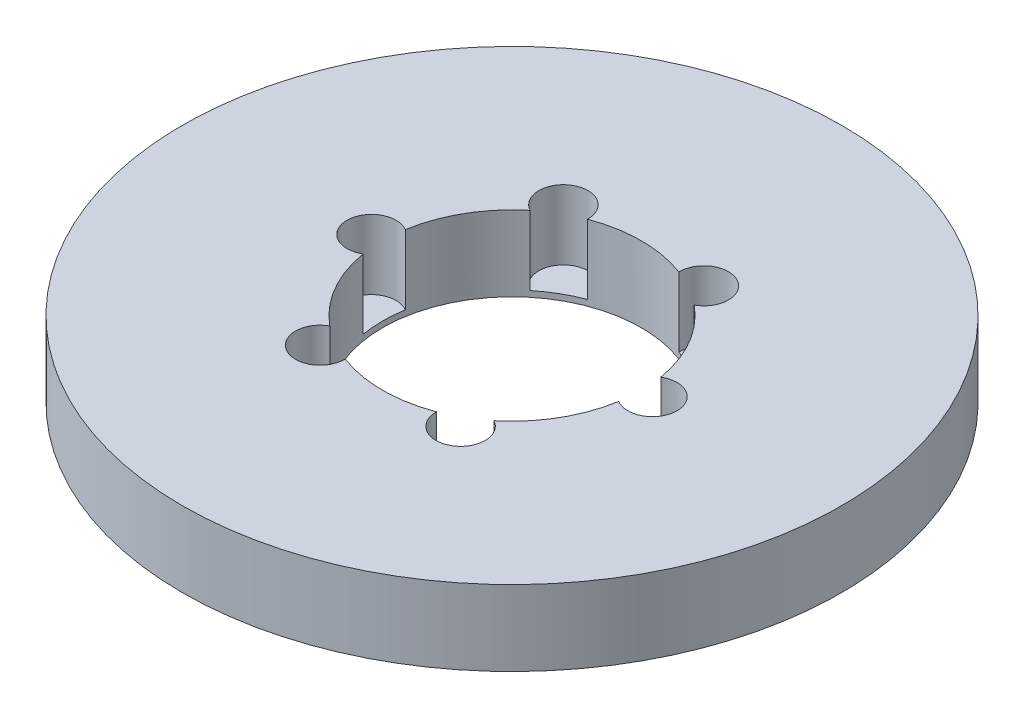
ISO-10303-21;
HEADER;
FILE_DESCRIPTION(('STEP AP214'),'2;1');
FILE_NAME('part.step','',(''),(''),'','','');
FILE_SCHEMA(('AUTOMOTIVE_DESIGN { 1 0 10303 214 1 1 1 1 }'));
ENDSEC;
DATA;
#1=APPLICATION_CONTEXT('core data for automotive mechanical design processes');
#2=APPLICATION_PROTOCOL_DEFINITION('international standard','automotive_design',2000,#1);
#3=PRODUCT_CONTEXT('',#1,'mechanical');
#4=PRODUCT('Part','Part','',(#3));
#5=PRODUCT_RELATED_PRODUCT_CATEGORY('part','',(#4));
#6=PRODUCT_DEFINITION_FORMATION('','',#4);
#7=PRODUCT_DEFINITION_CONTEXT('part definition',#1,'design');
#8=PRODUCT_DEFINITION('design','',#6,#7);
#9=PRODUCT_DEFINITION_SHAPE('','',#8);
#10=(LENGTH_UNIT() NAMED_UNIT(*) SI_UNIT(.MILLI.,.METRE.));
#11=(NAMED_UNIT(*) PLANE_ANGLE_UNIT() SI_UNIT($,.RADIAN.));
#12=(NAMED_UNIT(*) SI_UNIT($,.STERADIAN.) SOLID_ANGLE_UNIT());
#13=UNCERTAINTY_MEASURE_WITH_UNIT(LENGTH_MEASURE(1.E-05),#10,'distance_accuracy_value','');
#14=(GEOMETRIC_REPRESENTATION_CONTEXT(3) GLOBAL_UNCERTAINTY_ASSIGNED_CONTEXT((#13)) GLOBAL_UNIT_ASSIGNED_CONTEXT((#10,
#11,#12)) REPRESENTATION_CONTEXT('',''));
#15=CARTESIAN_POINT('',(0.,0.,0.));
#16=DIRECTION('',(0.,0.,1.));
#17=DIRECTION('',(1.,0.,0.));
#18=AXIS2_PLACEMENT_3D('',#15,#16,#17);
#19=CARTESIAN_POINT('',(0.,16.,0.));
#20=DIRECTION('',(0.,-1.,0.));
#21=DIRECTION('',(0.,0.,-1.));
#22=AXIS2_PLACEMENT_3D('',#19,#20,#21);
#23=CYLINDRICAL_SURFACE('',#22,70.);
#24=CARTESIAN_POINT('',(0.,16.,0.));
#25=DIRECTION('',(0.,1.,0.));
#26=DIRECTION('',(0.,0.,1.));
#27=AXIS2_PLACEMENT_3D('',#24,#25,#26);
#28=CIRCLE('',#27,70.);
#29=CARTESIAN_POINT('',(0.,16.,70.));
#30=VERTEX_POINT('',#29);
#31=EDGE_CURVE('E171',#30,#30,#28,.T.);
#32=ORIENTED_EDGE('',*,*,#31,.F.);
#33=EDGE_LOOP('',(#32));
#34=FACE_BOUND('',#33,.T.);
#35=CARTESIAN_POINT('',(0.,0.,0.));
#36=DIRECTION('',(0.,1.,0.));
#37=DIRECTION('',(0.,0.,1.));
#38=AXIS2_PLACEMENT_3D('',#35,#36,#37);
#39=CIRCLE('',#38,70.);
#40=CARTESIAN_POINT('',(0.,0.,70.));
#41=VERTEX_POINT('',#40);
#42=EDGE_CURVE('E157',#41,#41,#39,.T.);
#43=ORIENTED_EDGE('',*,*,#42,.T.);
#44=EDGE_LOOP('',(#43));
#45=FACE_BOUND('',#44,.T.);
#46=ADVANCED_FACE('F39',(#34,#45),#23,.T.);
#47=CARTESIAN_POINT('',(0.,16.,0.));
#48=DIRECTION('',(0.,1.,0.));
#49=DIRECTION('',(0.,0.,1.));
#50=AXIS2_PLACEMENT_3D('',#47,#48,#49);
#51=PLANE('',#50);
#52=CARTESIAN_POINT('',(-14.9195019596037,16.,-25.8413354176564));
#53=DIRECTION('',(0.,1.,0.));
#54=DIRECTION('',(-0.866025403784433,0.,0.50000000000001));
#55=AXIS2_PLACEMENT_3D('',#52,#53,#54);
#56=CIRCLE('',#55,5.21964115967071);
#57=CARTESIAN_POINT('',(-9.70100413533416,16.,-25.732091224116));
#58=VERTEX_POINT('',#57);
#59=CARTESIAN_POINT('',(-17.4341426249165,16.,-21.2673616354749));
#60=VERTEX_POINT('',#59);
#61=EDGE_CURVE('E214',#58,#60,#56,.T.);
#62=ORIENTED_EDGE('',*,*,#61,.F.);
#63=CARTESIAN_POINT('',(0.,16.,0.));
#64=DIRECTION('',(0.,1.,0.));
#65=DIRECTION('',(0.,0.,1.));
#66=AXIS2_PLACEMENT_3D('',#63,#64,#65);
#67=CIRCLE('',#66,27.5);
#68=CARTESIAN_POINT('',(9.70100413533362,16.,-25.7320912241162));
#69=VERTEX_POINT('',#68);
#70=EDGE_CURVE('E272',#69,#58,#67,.T.);
#71=ORIENTED_EDGE('',*,*,#70,.F.);
#72=CARTESIAN_POINT('',(14.9195019596032,16.,-25.8413354176567));
#73=DIRECTION('',(0.,1.,0.));
#74=DIRECTION('',(-0.866025403784443,0.,-0.499999999999992));
#75=AXIS2_PLACEMENT_3D('',#72,#73,#74);
#76=CIRCLE('',#75,5.21964115967071);
#77=CARTESIAN_POINT('',(17.4341426249161,16.,-21.2673616354753));
#78=VERTEX_POINT('',#77);
#79=EDGE_CURVE('E285',#78,#69,#76,.T.);
#80=ORIENTED_EDGE('',*,*,#79,.F.);
#81=CARTESIAN_POINT('',(27.1351467602501,16.,-4.46472958864106));
#82=VERTEX_POINT('',#81);
#83=EDGE_CURVE('E165',#82,#78,#67,.T.);
#84=ORIENTED_EDGE('',*,*,#83,.F.);
#85=CARTESIAN_POINT('',(29.8390039192069,16.,0.));
#86=DIRECTION('',(0.,1.,0.));
#87=DIRECTION('',(0.,0.,-1.));
#88=AXIS2_PLACEMENT_3D('',#85,#86,#87);
#89=CIRCLE('',#88,5.21964115967071);
#90=CARTESIAN_POINT('',(27.1351467602501,16.,4.46472958864106));
#91=VERTEX_POINT('',#90);
#92=EDGE_CURVE('E281',#91,#82,#89,.T.);
#93=ORIENTED_EDGE('',*,*,#92,.F.);
#94=CARTESIAN_POINT('',(17.4341426249164,16.,21.267361635475));
#95=VERTEX_POINT('',#94);
#96=EDGE_CURVE('E160',#95,#91,#67,.T.);
#97=ORIENTED_EDGE('',*,*,#96,.F.);
#98=CARTESIAN_POINT('',(14.9195019596036,16.,25.8413354176565));
#99=DIRECTION('',(0.,1.,0.));
#100=DIRECTION('',(0.866025403784436,0.,-0.500000000000004));
#101=AXIS2_PLACEMENT_3D('',#98,#99,#100);
#102=CIRCLE('',#101,5.21964115967071);
#103=CARTESIAN_POINT('',(9.70100413533398,16.,25.7320912241161));
#104=VERTEX_POINT('',#103);
#105=EDGE_CURVE('E154',#104,#95,#102,.T.);
#106=ORIENTED_EDGE('',*,*,#105,.F.);
#107=CARTESIAN_POINT('',(-9.7010041353338,16.,25.7320912241162));
#108=VERTEX_POINT('',#107);
#109=EDGE_CURVE('E150',#108,#104,#67,.T.);
#110=ORIENTED_EDGE('',*,*,#109,.F.);
#111=CARTESIAN_POINT('',(-14.9195019596034,16.,25.8413354176566));
#112=DIRECTION('',(0.,1.,0.));
#113=DIRECTION('',(0.86602540378444,0.,0.499999999999998));
#114=AXIS2_PLACEMENT_3D('',#111,#112,#113);
#115=CIRCLE('',#114,5.21964115967071);
#116=CARTESIAN_POINT('',(-17.4341426249162,16.,21.2673616354751));
#117=VERTEX_POINT('',#116);
#118=EDGE_CURVE('E127',#117,#108,#115,.T.);
#119=ORIENTED_EDGE('',*,*,#118,.F.);
#120=CARTESIAN_POINT('',(-27.1351467602501,16.,4.46472958864106));
#121=VERTEX_POINT('',#120);
#122=EDGE_CURVE('E156',#121,#117,#67,.T.);
#123=ORIENTED_EDGE('',*,*,#122,.F.);
#124=CARTESIAN_POINT('',(-29.8390039192069,16.,0.));
#125=DIRECTION('',(0.,1.,0.));
#126=DIRECTION('',(0.,0.,1.));
#127=AXIS2_PLACEMENT_3D('',#124,#125,#126);
#128=CIRCLE('',#127,5.21964115967071);
#129=CARTESIAN_POINT('',(-27.1351467602501,16.,-4.46472958864106));
#130=VERTEX_POINT('',#129);
#131=EDGE_CURVE('E164',#130,#121,#128,.T.);
#132=ORIENTED_EDGE('',*,*,#131,.F.);
#133=EDGE_CURVE('E159',#60,#130,#67,.T.);
#134=ORIENTED_EDGE('',*,*,#133,.F.);
#135=EDGE_LOOP('',(#62,#71,#80,#84,#93,#97,#106,#110,#119,#123,#132,#134));
#136=FACE_BOUND('',#135,.T.);
#137=ORIENTED_EDGE('',*,*,#31,.T.);
#138=EDGE_LOOP('',(#137));
#139=FACE_BOUND('',#138,.T.);
#140=ADVANCED_FACE('F155',(#136,#139),#51,.T.);
#141=CARTESIAN_POINT('',(0.,0.,0.));
#142=DIRECTION('',(0.,1.,0.));
#143=DIRECTION('',(0.,0.,1.));
#144=AXIS2_PLACEMENT_3D('',#141,#142,#143);
#145=PLANE('',#144);
#146=CARTESIAN_POINT('',(0.,0.,0.));
#147=DIRECTION('',(0.,1.,0.));
#148=DIRECTION('',(0.,0.,1.));
#149=AXIS2_PLACEMENT_3D('',#146,#147,#148);
#150=CIRCLE('',#149,27.5);
#151=CARTESIAN_POINT('',(0.,0.,27.5));
#152=VERTEX_POINT('',#151);
#153=EDGE_CURVE('E170',#152,#152,#150,.T.);
#154=ORIENTED_EDGE('',*,*,#153,.T.);
#155=EDGE_LOOP('',(#154));
#156=FACE_BOUND('',#155,.T.);
#157=ORIENTED_EDGE('',*,*,#42,.F.);
#158=EDGE_LOOP('',(#157));
#159=FACE_BOUND('',#158,.T.);
#160=ADVANCED_FACE('F232',(#156,#159),#145,.F.);
#161=CARTESIAN_POINT('',(0.,16.,0.));
#162=DIRECTION('',(0.,-1.,0.));
#163=DIRECTION('',(0.,0.,-1.));
#164=AXIS2_PLACEMENT_3D('',#161,#162,#163);
#165=CYLINDRICAL_SURFACE('',#164,27.5);
#166=DIRECTION('',(0.,1.,0.));
#167=VECTOR('',#166,1.);
#168=CARTESIAN_POINT('',(-9.70100413533416,8.61944924961575,-25.732091224116));
#169=LINE('',#168,#167);
#170=CARTESIAN_POINT('',(-9.70100413533416,1.23889849923151,-25.732091224116));
#171=VERTEX_POINT('',#170);
#172=EDGE_CURVE('E11',#171,#58,#169,.T.);
#173=ORIENTED_EDGE('',*,*,#172,.F.);
#174=CARTESIAN_POINT('',(0.,1.23889849923151,0.));
#175=DIRECTION('',(0.,1.,0.));
#176=DIRECTION('',(0.,0.,1.));
#177=AXIS2_PLACEMENT_3D('',#174,#175,#176);
#178=CIRCLE('',#177,27.5);
#179=CARTESIAN_POINT('',(-17.4341426249165,1.23889849923151,-21.2673616354749));
#180=VERTEX_POINT('',#179);
#181=EDGE_CURVE('E209',#171,#180,#178,.T.);
#182=ORIENTED_EDGE('',*,*,#181,.T.);
#183=DIRECTION('',(0.,1.,0.));
#184=VECTOR('',#183,1.);
#185=CARTESIAN_POINT('',(-17.4341426249165,8.61944924961575,-21.2673616354749));
#186=LINE('',#185,#184);
#187=EDGE_CURVE('E46',#60,#180,#186,.F.);
#188=ORIENTED_EDGE('',*,*,#187,.F.);
#189=ORIENTED_EDGE('',*,*,#133,.T.);
#190=DIRECTION('',(0.,1.,0.));
#191=VECTOR('',#190,1.);
#192=CARTESIAN_POINT('',(-27.1351467602501,8.61944924961575,-4.46472958864106));
#193=LINE('',#192,#191);
#194=CARTESIAN_POINT('',(-27.1351467602501,1.23889849923151,-4.46472958864106));
#195=VERTEX_POINT('',#194);
#196=EDGE_CURVE('E185',#195,#130,#193,.T.);
#197=ORIENTED_EDGE('',*,*,#196,.F.);
#198=CARTESIAN_POINT('',(0.,1.23889849923151,0.));
#199=DIRECTION('',(0.,1.,0.));
#200=DIRECTION('',(0.,0.,1.));
#201=AXIS2_PLACEMENT_3D('',#198,#199,#200);
#202=CIRCLE('',#201,27.5);
#203=CARTESIAN_POINT('',(-27.1351467602501,1.23889849923151,4.46472958864106));
#204=VERTEX_POINT('',#203);
#205=EDGE_CURVE('E173',#195,#204,#202,.T.);
#206=ORIENTED_EDGE('',*,*,#205,.T.);
#207=DIRECTION('',(0.,1.,0.));
#208=VECTOR('',#207,1.);
#209=CARTESIAN_POINT('',(-27.1351467602501,8.61944924961575,4.46472958864106));
#210=LINE('',#209,#208);
#211=EDGE_CURVE('E178',#121,#204,#210,.F.);
#212=ORIENTED_EDGE('',*,*,#211,.F.);
#213=ORIENTED_EDGE('',*,*,#122,.T.);
#214=DIRECTION('',(0.,1.,0.));
#215=VECTOR('',#214,1.);
#216=CARTESIAN_POINT('',(-17.4341426249162,8.61944924961575,21.2673616354751));
#217=LINE('',#216,#215);
#218=CARTESIAN_POINT('',(-17.4341426249162,1.23889849923151,21.2673616354751));
#219=VERTEX_POINT('',#218);
#220=EDGE_CURVE('E132',#219,#117,#217,.T.);
#221=ORIENTED_EDGE('',*,*,#220,.F.);
#222=CARTESIAN_POINT('',(0.,1.23889849923151,0.));
#223=DIRECTION('',(0.,1.,0.));
#224=DIRECTION('',(0.,0.,1.));
#225=AXIS2_PLACEMENT_3D('',#222,#223,#224);
#226=CIRCLE('',#225,27.5);
#227=CARTESIAN_POINT('',(-9.7010041353338,1.23889849923151,25.7320912241162));
#228=VERTEX_POINT('',#227);
#229=EDGE_CURVE('E146',#219,#228,#226,.T.);
#230=ORIENTED_EDGE('',*,*,#229,.T.);
#231=DIRECTION('',(0.,1.,0.));
#232=VECTOR('',#231,1.);
#233=CARTESIAN_POINT('',(-9.7010041353338,8.61944924961575,25.7320912241162));
#234=LINE('',#233,#232);
#235=EDGE_CURVE('E128',#108,#228,#234,.F.);
#236=ORIENTED_EDGE('',*,*,#235,.F.);
#237=ORIENTED_EDGE('',*,*,#109,.T.);
#238=DIRECTION('',(0.,1.,0.));
#239=VECTOR('',#238,1.);
#240=CARTESIAN_POINT('',(9.70100413533398,8.61944924961575,25.7320912241161));
#241=LINE('',#240,#239);
#242=CARTESIAN_POINT('',(9.70100413533398,1.23889849923151,25.7320912241161));
#243=VERTEX_POINT('',#242);
#244=EDGE_CURVE('E192',#243,#104,#241,.T.);
#245=ORIENTED_EDGE('',*,*,#244,.F.);
#246=CARTESIAN_POINT('',(0.,1.23889849923151,0.));
#247=DIRECTION('',(0.,1.,0.));
#248=DIRECTION('',(0.,0.,1.));
#249=AXIS2_PLACEMENT_3D('',#246,#247,#248);
#250=CIRCLE('',#249,27.5);
#251=CARTESIAN_POINT('',(17.4341426249164,1.23889849923151,21.267361635475));
#252=VERTEX_POINT('',#251);
#253=EDGE_CURVE('E190',#243,#252,#250,.T.);
#254=ORIENTED_EDGE('',*,*,#253,.T.);
#255=DIRECTION('',(0.,1.,0.));
#256=VECTOR('',#255,1.);
#257=CARTESIAN_POINT('',(17.4341426249164,8.61944924961575,21.267361635475));
#258=LINE('',#257,#256);
#259=EDGE_CURVE('E189',#95,#252,#258,.F.);
#260=ORIENTED_EDGE('',*,*,#259,.F.);
#261=ORIENTED_EDGE('',*,*,#96,.T.);
#262=DIRECTION('',(0.,1.,0.));
#263=VECTOR('',#262,1.);
#264=CARTESIAN_POINT('',(27.1351467602501,8.61944924961575,4.46472958864106));
#265=LINE('',#264,#263);
#266=CARTESIAN_POINT('',(27.1351467602501,1.23889849923151,4.46472958864106));
#267=VERTEX_POINT('',#266);
#268=EDGE_CURVE('E203',#267,#91,#265,.T.);
#269=ORIENTED_EDGE('',*,*,#268,.F.);
#270=CARTESIAN_POINT('',(0.,1.23889849923151,0.));
#271=DIRECTION('',(0.,1.,0.));
#272=DIRECTION('',(0.,0.,1.));
#273=AXIS2_PLACEMENT_3D('',#270,#271,#272);
#274=CIRCLE('',#273,27.5);
#275=CARTESIAN_POINT('',(27.1351467602501,1.23889849923151,-4.46472958864106));
#276=VERTEX_POINT('',#275);
#277=EDGE_CURVE('E194',#267,#276,#274,.T.);
#278=ORIENTED_EDGE('',*,*,#277,.T.);
#279=DIRECTION('',(0.,1.,0.));
#280=VECTOR('',#279,1.);
#281=CARTESIAN_POINT('',(27.1351467602501,8.61944924961575,-4.46472958864106));
#282=LINE('',#281,#280);
#283=EDGE_CURVE('E196',#82,#276,#282,.F.);
#284=ORIENTED_EDGE('',*,*,#283,.F.);
#285=ORIENTED_EDGE('',*,*,#83,.T.);
#286=DIRECTION('',(0.,1.,0.));
#287=VECTOR('',#286,1.);
#288=CARTESIAN_POINT('',(17.4341426249161,8.61944924961575,-21.2673616354752));
#289=LINE('',#288,#287);
#290=CARTESIAN_POINT('',(17.4341426249161,1.23889849923151,-21.2673616354753));
#291=VERTEX_POINT('',#290);
#292=EDGE_CURVE('E208',#291,#78,#289,.T.);
#293=ORIENTED_EDGE('',*,*,#292,.F.);
#294=CARTESIAN_POINT('',(0.,1.23889849923151,0.));
#295=DIRECTION('',(0.,1.,0.));
#296=DIRECTION('',(0.,0.,1.));
#297=AXIS2_PLACEMENT_3D('',#294,#295,#296);
#298=CIRCLE('',#297,27.5);
#299=CARTESIAN_POINT('',(9.70100413533362,1.23889849923151,-25.7320912241162));
#300=VERTEX_POINT('',#299);
#301=EDGE_CURVE('E201',#291,#300,#298,.T.);
#302=ORIENTED_EDGE('',*,*,#301,.T.);
#303=DIRECTION('',(0.,1.,0.));
#304=VECTOR('',#303,1.);
#305=CARTESIAN_POINT('',(9.70100413533362,8.61944924961575,-25.7320912241162));
#306=LINE('',#305,#304);
#307=EDGE_CURVE('E206',#69,#300,#306,.F.);
#308=ORIENTED_EDGE('',*,*,#307,.F.);
#309=ORIENTED_EDGE('',*,*,#70,.T.);
#310=EDGE_LOOP('',(#173,#182,#188,#189,#197,#206,#212,#213,#221,#230,#236,#237,#245,#254,#260,
#261,#269,#278,#284,#285,#293,#302,#308,#309));
#311=FACE_BOUND('',#310,.T.);
#312=ORIENTED_EDGE('',*,*,#153,.F.);
#313=EDGE_LOOP('',(#312));
#314=FACE_BOUND('',#313,.T.);
#315=ADVANCED_FACE('F145',(#311,#314),#165,.F.);
#316=CARTESIAN_POINT('',(-29.8390039192069,1.23889849923151,0.));
#317=DIRECTION('',(0.,1.,0.));
#318=DIRECTION('',(0.,0.,1.));
#319=AXIS2_PLACEMENT_3D('',#316,#317,#318);
#320=CYLINDRICAL_SURFACE('',#319,5.21964115967071);
#321=ORIENTED_EDGE('',*,*,#196,.T.);
#322=ORIENTED_EDGE('',*,*,#131,.T.);
#323=ORIENTED_EDGE('',*,*,#211,.T.);
#324=CARTESIAN_POINT('',(-29.8390039192069,1.23889849923151,0.));
#325=DIRECTION('',(0.,1.,0.));
#326=DIRECTION('',(0.,0.,1.));
#327=AXIS2_PLACEMENT_3D('',#324,#325,#326);
#328=CIRCLE('',#327,5.21964115967071);
#329=EDGE_CURVE('E168',#195,#204,#328,.T.);
#330=ORIENTED_EDGE('',*,*,#329,.F.);
#331=EDGE_LOOP('',(#321,#322,#323,#330));
#332=FACE_BOUND('',#331,.T.);
#333=ADVANCED_FACE('F243',(#332),#320,.F.);
#334=CARTESIAN_POINT('',(-29.8390039192069,1.23889849923151,0.));
#335=DIRECTION('',(0.,1.,0.));
#336=DIRECTION('',(0.,0.,1.));
#337=AXIS2_PLACEMENT_3D('',#334,#335,#336);
#338=PLANE('',#337);
#339=ORIENTED_EDGE('',*,*,#329,.T.);
#340=ORIENTED_EDGE('',*,*,#205,.F.);
#341=EDGE_LOOP('',(#339,#340));
#342=FACE_BOUND('',#341,.T.);
#343=ADVANCED_FACE('F247',(#342),#338,.T.);
#344=CARTESIAN_POINT('',(-14.9195019596034,1.23889849923151,25.8413354176566));
#345=DIRECTION('',(0.,1.,0.));
#346=DIRECTION('',(0.,0.,1.));
#347=AXIS2_PLACEMENT_3D('',#344,#345,#346);
#348=CYLINDRICAL_SURFACE('',#347,5.21964115967071);
#349=ORIENTED_EDGE('',*,*,#220,.T.);
#350=ORIENTED_EDGE('',*,*,#118,.T.);
#351=ORIENTED_EDGE('',*,*,#235,.T.);
#352=CARTESIAN_POINT('',(-14.9195019596034,1.23889849923151,25.8413354176566));
#353=DIRECTION('',(0.,1.,0.));
#354=DIRECTION('',(0.86602540378444,0.,0.499999999999998));
#355=AXIS2_PLACEMENT_3D('',#352,#353,#354);
#356=CIRCLE('',#355,5.21964115967071);
#357=EDGE_CURVE('E137',#219,#228,#356,.T.);
#358=ORIENTED_EDGE('',*,*,#357,.F.);
#359=EDGE_LOOP('',(#349,#350,#351,#358));
#360=FACE_BOUND('',#359,.T.);
#361=ADVANCED_FACE('F126',(#360),#348,.F.);
#362=CARTESIAN_POINT('',(-14.9195019596034,1.23889849923151,25.8413354176566));
#363=DIRECTION('',(0.,1.,0.));
#364=DIRECTION('',(0.86602540378444,0.,0.499999999999998));
#365=AXIS2_PLACEMENT_3D('',#362,#363,#364);
#366=PLANE('',#365);
#367=ORIENTED_EDGE('',*,*,#357,.T.);
#368=ORIENTED_EDGE('',*,*,#229,.F.);
#369=EDGE_LOOP('',(#367,#368));
#370=FACE_BOUND('',#369,.T.);
#371=ADVANCED_FACE('F254',(#370),#366,.T.);
#372=CARTESIAN_POINT('',(14.9195019596036,1.23889849923151,25.8413354176565));
#373=DIRECTION('',(0.,1.,0.));
#374=DIRECTION('',(0.,0.,1.));
#375=AXIS2_PLACEMENT_3D('',#372,#373,#374);
#376=CYLINDRICAL_SURFACE('',#375,5.21964115967071);
#377=ORIENTED_EDGE('',*,*,#244,.T.);
#378=ORIENTED_EDGE('',*,*,#105,.T.);
#379=ORIENTED_EDGE('',*,*,#259,.T.);
#380=CARTESIAN_POINT('',(14.9195019596036,1.23889849923151,25.8413354176565));
#381=DIRECTION('',(0.,1.,0.));
#382=DIRECTION('',(0.866025403784436,0.,-0.500000000000004));
#383=AXIS2_PLACEMENT_3D('',#380,#381,#382);
#384=CIRCLE('',#383,5.21964115967071);
#385=EDGE_CURVE('E138',#243,#252,#384,.T.);
#386=ORIENTED_EDGE('',*,*,#385,.F.);
#387=EDGE_LOOP('',(#377,#378,#379,#386));
#388=FACE_BOUND('',#387,.T.);
#389=ADVANCED_FACE('F260',(#388),#376,.F.);
#390=CARTESIAN_POINT('',(14.9195019596036,1.23889849923151,25.8413354176565));
#391=DIRECTION('',(0.,1.,0.));
#392=DIRECTION('',(0.866025403784436,0.,-0.500000000000004));
#393=AXIS2_PLACEMENT_3D('',#390,#391,#392);
#394=PLANE('',#393);
#395=ORIENTED_EDGE('',*,*,#385,.T.);
#396=ORIENTED_EDGE('',*,*,#253,.F.);
#397=EDGE_LOOP('',(#395,#396));
#398=FACE_BOUND('',#397,.T.);
#399=ADVANCED_FACE('F265',(#398),#394,.T.);
#400=CARTESIAN_POINT('',(29.8390039192069,1.23889849923151,0.));
#401=DIRECTION('',(0.,1.,0.));
#402=DIRECTION('',(0.,0.,1.));
#403=AXIS2_PLACEMENT_3D('',#400,#401,#402);
#404=CYLINDRICAL_SURFACE('',#403,5.21964115967071);
#405=ORIENTED_EDGE('',*,*,#268,.T.);
#406=ORIENTED_EDGE('',*,*,#92,.T.);
#407=ORIENTED_EDGE('',*,*,#283,.T.);
#408=CARTESIAN_POINT('',(29.8390039192069,1.23889849923151,0.));
#409=DIRECTION('',(0.,1.,0.));
#410=DIRECTION('',(0.,0.,-1.));
#411=AXIS2_PLACEMENT_3D('',#408,#409,#410);
#412=CIRCLE('',#411,5.21964115967071);
#413=EDGE_CURVE('E287',#267,#276,#412,.T.);
#414=ORIENTED_EDGE('',*,*,#413,.F.);
#415=EDGE_LOOP('',(#405,#406,#407,#414));
#416=FACE_BOUND('',#415,.T.);
#417=ADVANCED_FACE('F300',(#416),#404,.F.);
#418=CARTESIAN_POINT('',(29.8390039192069,1.23889849923151,0.));
#419=DIRECTION('',(0.,1.,0.));
#420=DIRECTION('',(0.,0.,-1.));
#421=AXIS2_PLACEMENT_3D('',#418,#419,#420);
#422=PLANE('',#421);
#423=ORIENTED_EDGE('',*,*,#413,.T.);
#424=ORIENTED_EDGE('',*,*,#277,.F.);
#425=EDGE_LOOP('',(#423,#424));
#426=FACE_BOUND('',#425,.T.);
#427=ADVANCED_FACE('F298',(#426),#422,.T.);
#428=CARTESIAN_POINT('',(14.9195019596032,1.23889849923151,-25.8413354176567));
#429=DIRECTION('',(0.,1.,0.));
#430=DIRECTION('',(0.,0.,1.));
#431=AXIS2_PLACEMENT_3D('',#428,#429,#430);
#432=CYLINDRICAL_SURFACE('',#431,5.21964115967071);
#433=ORIENTED_EDGE('',*,*,#292,.T.);
#434=ORIENTED_EDGE('',*,*,#79,.T.);
#435=ORIENTED_EDGE('',*,*,#307,.T.);
#436=CARTESIAN_POINT('',(14.9195019596032,1.23889849923151,-25.8413354176567));
#437=DIRECTION('',(0.,1.,0.));
#438=DIRECTION('',(-0.866025403784443,0.,-0.499999999999992));
#439=AXIS2_PLACEMENT_3D('',#436,#437,#438);
#440=CIRCLE('',#439,5.21964115967071);
#441=EDGE_CURVE('E56',#291,#300,#440,.T.);
#442=ORIENTED_EDGE('',*,*,#441,.F.);
#443=EDGE_LOOP('',(#433,#434,#435,#442));
#444=FACE_BOUND('',#443,.T.);
#445=ADVANCED_FACE('F301',(#444),#432,.F.);
#446=CARTESIAN_POINT('',(14.9195019596032,1.23889849923151,-25.8413354176567));
#447=DIRECTION('',(0.,1.,0.));
#448=DIRECTION('',(-0.866025403784443,0.,-0.499999999999992));
#449=AXIS2_PLACEMENT_3D('',#446,#447,#448);
#450=PLANE('',#449);
#451=ORIENTED_EDGE('',*,*,#441,.T.);
#452=ORIENTED_EDGE('',*,*,#301,.F.);
#453=EDGE_LOOP('',(#451,#452));
#454=FACE_BOUND('',#453,.T.);
#455=ADVANCED_FACE('F221',(#454),#450,.T.);
#456=CARTESIAN_POINT('',(-14.9195019596037,1.23889849923151,-25.8413354176564));
#457=DIRECTION('',(0.,1.,0.));
#458=DIRECTION('',(0.,0.,1.));
#459=AXIS2_PLACEMENT_3D('',#456,#457,#458);
#460=CYLINDRICAL_SURFACE('',#459,5.21964115967071);
#461=ORIENTED_EDGE('',*,*,#172,.T.);
#462=ORIENTED_EDGE('',*,*,#61,.T.);
#463=ORIENTED_EDGE('',*,*,#187,.T.);
#464=CARTESIAN_POINT('',(-14.9195019596037,1.23889849923151,-25.8413354176564));
#465=DIRECTION('',(0.,1.,0.));
#466=DIRECTION('',(-0.866025403784433,0.,0.50000000000001));
#467=AXIS2_PLACEMENT_3D('',#464,#465,#466);
#468=CIRCLE('',#467,5.21964115967071);
#469=EDGE_CURVE('E55',#171,#180,#468,.T.);
#470=ORIENTED_EDGE('',*,*,#469,.F.);
#471=EDGE_LOOP('',(#461,#462,#463,#470));
#472=FACE_BOUND('',#471,.T.);
#473=ADVANCED_FACE('F212',(#472),#460,.F.);
#474=CARTESIAN_POINT('',(-14.9195019596037,1.23889849923151,-25.8413354176564));
#475=DIRECTION('',(0.,1.,0.));
#476=DIRECTION('',(-0.866025403784433,0.,0.50000000000001));
#477=AXIS2_PLACEMENT_3D('',#474,#475,#476);
#478=PLANE('',#477);
#479=ORIENTED_EDGE('',*,*,#469,.T.);
#480=ORIENTED_EDGE('',*,*,#181,.F.);
#481=EDGE_LOOP('',(#479,#480));
#482=FACE_BOUND('',#481,.T.);
#483=ADVANCED_FACE('F217',(#482),#478,.T.);
#484=CLOSED_SHELL('',(#46,#140,#160,#315,#333,#343,#361,#371,#389,#399,#417,#427,#445,#455,#473,#483));
#485=MANIFOLD_SOLID_BREP('B2',#484);
#486=ADVANCED_BREP_SHAPE_REPRESENTATION('',(#18,#485),#14);
#487=SHAPE_DEFINITION_REPRESENTATION(#9,#486);
ENDSEC;
END-ISO-10303-21;
